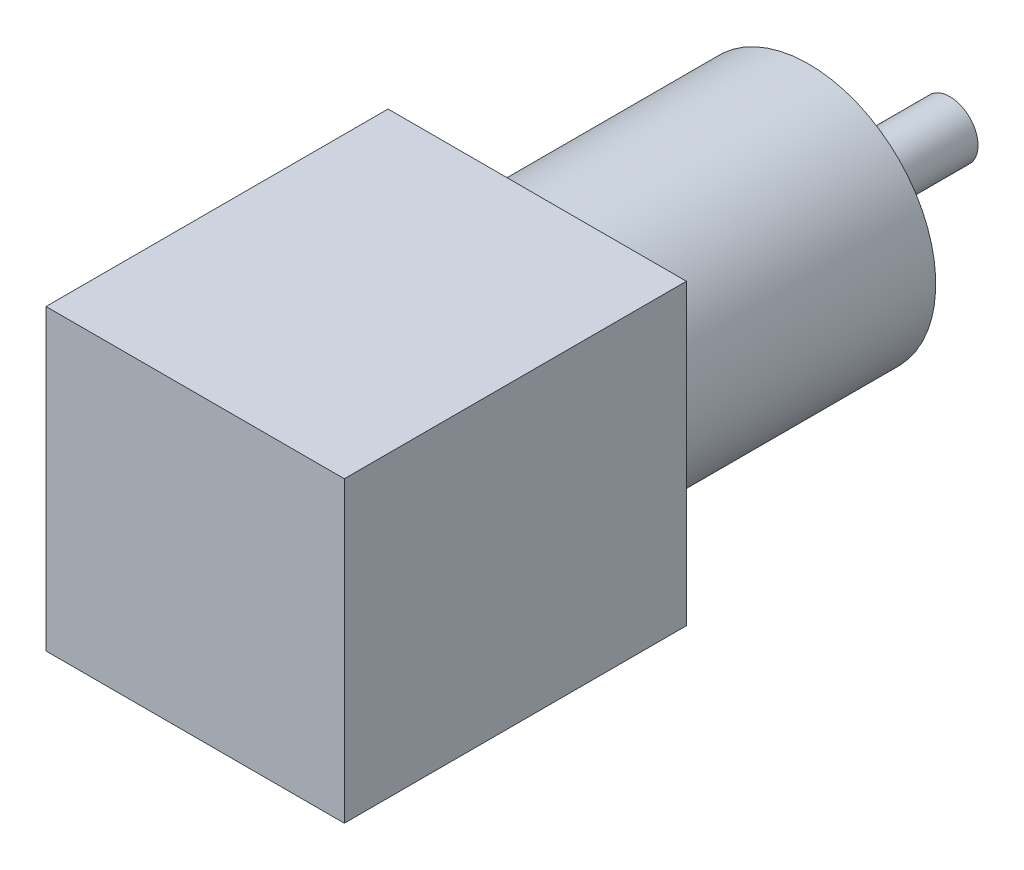
ISO-10303-21;
HEADER;
FILE_DESCRIPTION(('STEP AP214'),'2;1');
FILE_NAME('part.step','',(''),(''),'','','');
FILE_SCHEMA(('AUTOMOTIVE_DESIGN { 1 0 10303 214 1 1 1 1 }'));
ENDSEC;
DATA;
#1=APPLICATION_CONTEXT('core data for automotive mechanical design processes');
#2=APPLICATION_PROTOCOL_DEFINITION('international standard','automotive_design',2000,#1);
#3=PRODUCT_CONTEXT('',#1,'mechanical');
#4=PRODUCT('Part','Part','',(#3));
#5=PRODUCT_RELATED_PRODUCT_CATEGORY('part','',(#4));
#6=PRODUCT_DEFINITION_FORMATION('','',#4);
#7=PRODUCT_DEFINITION_CONTEXT('part definition',#1,'design');
#8=PRODUCT_DEFINITION('design','',#6,#7);
#9=PRODUCT_DEFINITION_SHAPE('','',#8);
#10=(LENGTH_UNIT() NAMED_UNIT(*) SI_UNIT(.MILLI.,.METRE.));
#11=(NAMED_UNIT(*) PLANE_ANGLE_UNIT() SI_UNIT($,.RADIAN.));
#12=(NAMED_UNIT(*) SI_UNIT($,.STERADIAN.) SOLID_ANGLE_UNIT());
#13=UNCERTAINTY_MEASURE_WITH_UNIT(LENGTH_MEASURE(1.E-05),#10,'distance_accuracy_value','');
#14=(GEOMETRIC_REPRESENTATION_CONTEXT(3) GLOBAL_UNCERTAINTY_ASSIGNED_CONTEXT((#13)) GLOBAL_UNIT_ASSIGNED_CONTEXT((#10,
#11,#12)) REPRESENTATION_CONTEXT('',''));
#15=CARTESIAN_POINT('',(0.,0.,0.));
#16=DIRECTION('',(0.,0.,1.));
#17=DIRECTION('',(1.,0.,0.));
#18=AXIS2_PLACEMENT_3D('',#15,#16,#17);
#19=CARTESIAN_POINT('',(21.15,21.15,48.5));
#20=DIRECTION('',(-1.,0.,0.));
#21=DIRECTION('',(0.,0.,1.));
#22=AXIS2_PLACEMENT_3D('',#19,#20,#21);
#23=PLANE('',#22);
#24=DIRECTION('',(0.,1.,0.));
#25=VECTOR('',#24,1.);
#26=CARTESIAN_POINT('',(21.15,21.15,0.));
#27=LINE('',#26,#25);
#28=CARTESIAN_POINT('',(21.15,-21.15,0.));
#29=VERTEX_POINT('',#28);
#30=CARTESIAN_POINT('',(21.15,21.15,0.));
#31=VERTEX_POINT('',#30);
#32=EDGE_CURVE('E107',#29,#31,#27,.T.);
#33=ORIENTED_EDGE('',*,*,#32,.T.);
#34=DIRECTION('',(0.,0.,-1.));
#35=VECTOR('',#34,1.);
#36=CARTESIAN_POINT('',(21.15,21.15,48.5));
#37=LINE('',#36,#35);
#38=CARTESIAN_POINT('',(21.15,21.15,48.5));
#39=VERTEX_POINT('',#38);
#40=EDGE_CURVE('E43',#39,#31,#37,.T.);
#41=ORIENTED_EDGE('',*,*,#40,.F.);
#42=DIRECTION('',(0.,1.,0.));
#43=VECTOR('',#42,1.);
#44=CARTESIAN_POINT('',(21.15,21.15,48.5));
#45=LINE('',#44,#43);
#46=CARTESIAN_POINT('',(21.15,-21.15,48.5));
#47=VERTEX_POINT('',#46);
#48=EDGE_CURVE('E94',#47,#39,#45,.T.);
#49=ORIENTED_EDGE('',*,*,#48,.F.);
#50=DIRECTION('',(0.,0.,-1.));
#51=VECTOR('',#50,1.);
#52=CARTESIAN_POINT('',(21.15,-21.15,48.5));
#53=LINE('',#52,#51);
#54=EDGE_CURVE('E103',#47,#29,#53,.T.);
#55=ORIENTED_EDGE('',*,*,#54,.T.);
#56=EDGE_LOOP('',(#33,#41,#49,#55));
#57=FACE_BOUND('',#56,.T.);
#58=ADVANCED_FACE('F40',(#57),#23,.F.);
#59=CARTESIAN_POINT('',(-21.15,21.15,48.5));
#60=DIRECTION('',(0.,-1.,0.));
#61=DIRECTION('',(0.,0.,-1.));
#62=AXIS2_PLACEMENT_3D('',#59,#60,#61);
#63=PLANE('',#62);
#64=DIRECTION('',(-1.,0.,0.));
#65=VECTOR('',#64,1.);
#66=CARTESIAN_POINT('',(-21.15,21.15,0.));
#67=LINE('',#66,#65);
#68=CARTESIAN_POINT('',(-21.15,21.15,0.));
#69=VERTEX_POINT('',#68);
#70=EDGE_CURVE('E99',#31,#69,#67,.T.);
#71=ORIENTED_EDGE('',*,*,#70,.T.);
#72=DIRECTION('',(0.,0.,-1.));
#73=VECTOR('',#72,1.);
#74=CARTESIAN_POINT('',(-21.15,21.15,48.5));
#75=LINE('',#74,#73);
#76=CARTESIAN_POINT('',(-21.15,21.15,48.5));
#77=VERTEX_POINT('',#76);
#78=EDGE_CURVE('E97',#77,#69,#75,.T.);
#79=ORIENTED_EDGE('',*,*,#78,.F.);
#80=DIRECTION('',(-1.,0.,0.));
#81=VECTOR('',#80,1.);
#82=CARTESIAN_POINT('',(-21.15,21.15,48.5));
#83=LINE('',#82,#81);
#84=EDGE_CURVE('E89',#39,#77,#83,.T.);
#85=ORIENTED_EDGE('',*,*,#84,.F.);
#86=ORIENTED_EDGE('',*,*,#40,.T.);
#87=EDGE_LOOP('',(#71,#79,#85,#86));
#88=FACE_BOUND('',#87,.T.);
#89=ADVANCED_FACE('F98',(#88),#63,.F.);
#90=CARTESIAN_POINT('',(-21.15,21.15,48.5));
#91=DIRECTION('',(1.,0.,0.));
#92=DIRECTION('',(0.,1.,0.));
#93=AXIS2_PLACEMENT_3D('',#90,#91,#92);
#94=PLANE('',#93);
#95=DIRECTION('',(0.,-1.,0.));
#96=VECTOR('',#95,1.);
#97=CARTESIAN_POINT('',(-21.15,21.15,0.));
#98=LINE('',#97,#96);
#99=CARTESIAN_POINT('',(-21.15,-21.15,0.));
#100=VERTEX_POINT('',#99);
#101=EDGE_CURVE('E75',#69,#100,#98,.T.);
#102=ORIENTED_EDGE('',*,*,#101,.T.);
#103=DIRECTION('',(0.,0.,-1.));
#104=VECTOR('',#103,1.);
#105=CARTESIAN_POINT('',(-21.15,-21.15,48.5));
#106=LINE('',#105,#104);
#107=CARTESIAN_POINT('',(-21.15,-21.15,48.5));
#108=VERTEX_POINT('',#107);
#109=EDGE_CURVE('E100',#108,#100,#106,.T.);
#110=ORIENTED_EDGE('',*,*,#109,.F.);
#111=DIRECTION('',(0.,-1.,0.));
#112=VECTOR('',#111,1.);
#113=CARTESIAN_POINT('',(-21.15,21.15,48.5));
#114=LINE('',#113,#112);
#115=EDGE_CURVE('E92',#77,#108,#114,.T.);
#116=ORIENTED_EDGE('',*,*,#115,.F.);
#117=ORIENTED_EDGE('',*,*,#78,.T.);
#118=EDGE_LOOP('',(#102,#110,#116,#117));
#119=FACE_BOUND('',#118,.T.);
#120=ADVANCED_FACE('F101',(#119),#94,.F.);
#121=CARTESIAN_POINT('',(-21.15,-21.15,48.5));
#122=DIRECTION('',(0.,1.,0.));
#123=DIRECTION('',(0.,0.,1.));
#124=AXIS2_PLACEMENT_3D('',#121,#122,#123);
#125=PLANE('',#124);
#126=DIRECTION('',(1.,0.,0.));
#127=VECTOR('',#126,1.);
#128=CARTESIAN_POINT('',(-21.15,-21.15,0.));
#129=LINE('',#128,#127);
#130=EDGE_CURVE('E81',#100,#29,#129,.T.);
#131=ORIENTED_EDGE('',*,*,#130,.T.);
#132=ORIENTED_EDGE('',*,*,#54,.F.);
#133=DIRECTION('',(1.,0.,0.));
#134=VECTOR('',#133,1.);
#135=CARTESIAN_POINT('',(-21.15,-21.15,48.5));
#136=LINE('',#135,#134);
#137=EDGE_CURVE('E58',#108,#47,#136,.T.);
#138=ORIENTED_EDGE('',*,*,#137,.F.);
#139=ORIENTED_EDGE('',*,*,#109,.T.);
#140=EDGE_LOOP('',(#131,#132,#138,#139));
#141=FACE_BOUND('',#140,.T.);
#142=ADVANCED_FACE('F115',(#141),#125,.F.);
#143=CARTESIAN_POINT('',(0.,0.,48.5));
#144=DIRECTION('',(0.,0.,1.));
#145=DIRECTION('',(1.,0.,0.));
#146=AXIS2_PLACEMENT_3D('',#143,#144,#145);
#147=PLANE('',#146);
#148=ORIENTED_EDGE('',*,*,#48,.T.);
#149=ORIENTED_EDGE('',*,*,#84,.T.);
#150=ORIENTED_EDGE('',*,*,#115,.T.);
#151=ORIENTED_EDGE('',*,*,#137,.T.);
#152=EDGE_LOOP('',(#148,#149,#150,#151));
#153=FACE_BOUND('',#152,.T.);
#154=ADVANCED_FACE('F90',(#153),#147,.T.);
#155=CARTESIAN_POINT('',(0.,0.,0.));
#156=DIRECTION('',(0.,0.,1.));
#157=DIRECTION('',(1.,0.,0.));
#158=AXIS2_PLACEMENT_3D('',#155,#156,#157);
#159=PLANE('',#158);
#160=CARTESIAN_POINT('',(0.,0.,0.));
#161=DIRECTION('',(0.,0.,-1.));
#162=DIRECTION('',(-1.,0.,0.));
#163=AXIS2_PLACEMENT_3D('',#160,#161,#162);
#164=CIRCLE('',#163,18.);
#165=CARTESIAN_POINT('',(-18.,0.,0.));
#166=VERTEX_POINT('',#165);
#167=EDGE_CURVE('E49',#166,#166,#164,.T.);
#168=ORIENTED_EDGE('',*,*,#167,.F.);
#169=EDGE_LOOP('',(#168));
#170=FACE_BOUND('',#169,.T.);
#171=ORIENTED_EDGE('',*,*,#32,.F.);
#172=ORIENTED_EDGE('',*,*,#130,.F.);
#173=ORIENTED_EDGE('',*,*,#101,.F.);
#174=ORIENTED_EDGE('',*,*,#70,.F.);
#175=EDGE_LOOP('',(#171,#172,#173,#174));
#176=FACE_BOUND('',#175,.T.);
#177=ADVANCED_FACE('F118',(#170,#176),#159,.F.);
#178=CARTESIAN_POINT('',(0.,0.,-38.5));
#179=DIRECTION('',(0.,0.,1.));
#180=DIRECTION('',(1.,0.,0.));
#181=AXIS2_PLACEMENT_3D('',#178,#179,#180);
#182=CYLINDRICAL_SURFACE('',#181,18.);
#183=CARTESIAN_POINT('',(0.,0.,-38.5));
#184=DIRECTION('',(0.,0.,-1.));
#185=DIRECTION('',(-1.,0.,0.));
#186=AXIS2_PLACEMENT_3D('',#183,#184,#185);
#187=CIRCLE('',#186,18.);
#188=CARTESIAN_POINT('',(-18.,0.,-38.5));
#189=VERTEX_POINT('',#188);
#190=EDGE_CURVE('E110',#189,#189,#187,.T.);
#191=ORIENTED_EDGE('',*,*,#190,.F.);
#192=EDGE_LOOP('',(#191));
#193=FACE_BOUND('',#192,.T.);
#194=ORIENTED_EDGE('',*,*,#167,.T.);
#195=EDGE_LOOP('',(#194));
#196=FACE_BOUND('',#195,.T.);
#197=ADVANCED_FACE('F166',(#193,#196),#182,.T.);
#198=CARTESIAN_POINT('',(0.,0.,-38.5));
#199=DIRECTION('',(0.,0.,-1.));
#200=DIRECTION('',(-1.,0.,0.));
#201=AXIS2_PLACEMENT_3D('',#198,#199,#200);
#202=PLANE('',#201);
#203=CARTESIAN_POINT('',(10.6066017177982,-10.6066017177983,-38.5));
#204=DIRECTION('',(0.,0.,-1.));
#205=DIRECTION('',(1.,0.,0.));
#206=AXIS2_PLACEMENT_3D('',#203,#204,#205);
#207=CIRCLE('',#206,1.5);
#208=CARTESIAN_POINT('',(12.1066017177982,-10.6066017177983,-38.5));
#209=VERTEX_POINT('',#208);
#210=EDGE_CURVE('E135',#209,#209,#207,.T.);
#211=ORIENTED_EDGE('',*,*,#210,.F.);
#212=EDGE_LOOP('',(#211));
#213=FACE_BOUND('',#212,.T.);
#214=CARTESIAN_POINT('',(-10.6066017177982,-10.6066017177983,-38.5));
#215=DIRECTION('',(0.,0.,-1.));
#216=DIRECTION('',(-1.,0.,0.));
#217=AXIS2_PLACEMENT_3D('',#214,#215,#216);
#218=CIRCLE('',#217,1.5);
#219=CARTESIAN_POINT('',(-12.1066017177982,-10.6066017177983,-38.5));
#220=VERTEX_POINT('',#219);
#221=EDGE_CURVE('E141',#220,#220,#218,.T.);
#222=ORIENTED_EDGE('',*,*,#221,.F.);
#223=EDGE_LOOP('',(#222));
#224=FACE_BOUND('',#223,.T.);
#225=CARTESIAN_POINT('',(-10.6066017177982,10.6066017177983,-38.5));
#226=DIRECTION('',(0.,0.,-1.));
#227=DIRECTION('',(1.,0.,0.));
#228=AXIS2_PLACEMENT_3D('',#225,#226,#227);
#229=CIRCLE('',#228,1.5);
#230=CARTESIAN_POINT('',(-9.10660171779816,10.6066017177983,-38.5));
#231=VERTEX_POINT('',#230);
#232=EDGE_CURVE('E147',#231,#231,#229,.T.);
#233=ORIENTED_EDGE('',*,*,#232,.F.);
#234=EDGE_LOOP('',(#233));
#235=FACE_BOUND('',#234,.T.);
#236=CARTESIAN_POINT('',(10.6066017177982,10.6066017177983,-38.5));
#237=DIRECTION('',(0.,0.,-1.));
#238=DIRECTION('',(-1.,0.,0.));
#239=AXIS2_PLACEMENT_3D('',#236,#237,#238);
#240=CIRCLE('',#239,1.5);
#241=CARTESIAN_POINT('',(9.10660171779816,10.6066017177983,-38.5));
#242=VERTEX_POINT('',#241);
#243=EDGE_CURVE('E129',#242,#242,#240,.T.);
#244=ORIENTED_EDGE('',*,*,#243,.F.);
#245=EDGE_LOOP('',(#244));
#246=FACE_BOUND('',#245,.T.);
#247=CARTESIAN_POINT('',(0.,0.,-38.5));
#248=DIRECTION('',(0.,0.,-1.));
#249=DIRECTION('',(-1.,0.,0.));
#250=AXIS2_PLACEMENT_3D('',#247,#248,#249);
#251=CIRCLE('',#250,4.);
#252=CARTESIAN_POINT('',(-4.,0.,-38.5));
#253=VERTEX_POINT('',#252);
#254=EDGE_CURVE('E11',#253,#253,#251,.T.);
#255=ORIENTED_EDGE('',*,*,#254,.F.);
#256=EDGE_LOOP('',(#255));
#257=FACE_BOUND('',#256,.T.);
#258=ORIENTED_EDGE('',*,*,#190,.T.);
#259=EDGE_LOOP('',(#258));
#260=FACE_BOUND('',#259,.T.);
#261=ADVANCED_FACE('F162',(#213,#224,#235,#246,#257,#260),#202,.T.);
#262=CARTESIAN_POINT('',(0.,0.,-58.5));
#263=DIRECTION('',(0.,0.,1.));
#264=DIRECTION('',(1.,0.,0.));
#265=AXIS2_PLACEMENT_3D('',#262,#263,#264);
#266=CYLINDRICAL_SURFACE('',#265,4.);
#267=CARTESIAN_POINT('',(0.,0.,-58.5));
#268=DIRECTION('',(0.,0.,-1.));
#269=DIRECTION('',(-1.,0.,0.));
#270=AXIS2_PLACEMENT_3D('',#267,#268,#269);
#271=CIRCLE('',#270,4.);
#272=CARTESIAN_POINT('',(-4.,0.,-58.5));
#273=VERTEX_POINT('',#272);
#274=EDGE_CURVE('E124',#273,#273,#271,.T.);
#275=ORIENTED_EDGE('',*,*,#274,.F.);
#276=EDGE_LOOP('',(#275));
#277=FACE_BOUND('',#276,.T.);
#278=ORIENTED_EDGE('',*,*,#254,.T.);
#279=EDGE_LOOP('',(#278));
#280=FACE_BOUND('',#279,.T.);
#281=ADVANCED_FACE('F165',(#277,#280),#266,.T.);
#282=CARTESIAN_POINT('',(0.,0.,-58.5));
#283=DIRECTION('',(0.,0.,-1.));
#284=DIRECTION('',(-1.,0.,0.));
#285=AXIS2_PLACEMENT_3D('',#282,#283,#284);
#286=PLANE('',#285);
#287=ORIENTED_EDGE('',*,*,#274,.T.);
#288=EDGE_LOOP('',(#287));
#289=FACE_BOUND('',#288,.T.);
#290=ADVANCED_FACE('F224',(#289),#286,.T.);
#291=CARTESIAN_POINT('',(10.6066017177982,10.6066017177983,-28.5));
#292=DIRECTION('',(0.,0.,-1.));
#293=DIRECTION('',(-1.,0.,0.));
#294=AXIS2_PLACEMENT_3D('',#291,#292,#293);
#295=CYLINDRICAL_SURFACE('',#294,1.5);
#296=CARTESIAN_POINT('',(10.6066017177982,10.6066017177983,-28.5));
#297=DIRECTION('',(0.,0.,-1.));
#298=DIRECTION('',(-1.,0.,0.));
#299=AXIS2_PLACEMENT_3D('',#296,#297,#298);
#300=CIRCLE('',#299,1.5);
#301=CARTESIAN_POINT('',(9.10660171779816,10.6066017177983,-28.5));
#302=VERTEX_POINT('',#301);
#303=EDGE_CURVE('E128',#302,#302,#300,.T.);
#304=ORIENTED_EDGE('',*,*,#303,.F.);
#305=EDGE_LOOP('',(#304));
#306=FACE_BOUND('',#305,.T.);
#307=ORIENTED_EDGE('',*,*,#243,.T.);
#308=EDGE_LOOP('',(#307));
#309=FACE_BOUND('',#308,.T.);
#310=ADVANCED_FACE('F234',(#306,#309),#295,.F.);
#311=CARTESIAN_POINT('',(10.6066017177982,10.6066017177983,-28.5));
#312=DIRECTION('',(0.,0.,-1.));
#313=DIRECTION('',(-1.,0.,0.));
#314=AXIS2_PLACEMENT_3D('',#311,#312,#313);
#315=PLANE('',#314);
#316=ORIENTED_EDGE('',*,*,#303,.T.);
#317=EDGE_LOOP('',(#316));
#318=FACE_BOUND('',#317,.T.);
#319=ADVANCED_FACE('F158',(#318),#315,.T.);
#320=CARTESIAN_POINT('',(-10.6066017177982,10.6066017177983,-28.5));
#321=DIRECTION('',(0.,0.,-1.));
#322=DIRECTION('',(-1.,0.,0.));
#323=AXIS2_PLACEMENT_3D('',#320,#321,#322);
#324=CYLINDRICAL_SURFACE('',#323,1.5);
#325=CARTESIAN_POINT('',(-10.6066017177982,10.6066017177983,-28.5));
#326=DIRECTION('',(0.,0.,-1.));
#327=DIRECTION('',(1.,0.,0.));
#328=AXIS2_PLACEMENT_3D('',#325,#326,#327);
#329=CIRCLE('',#328,1.5);
#330=CARTESIAN_POINT('',(-9.10660171779816,10.6066017177983,-28.5));
#331=VERTEX_POINT('',#330);
#332=EDGE_CURVE('E132',#331,#331,#329,.T.);
#333=ORIENTED_EDGE('',*,*,#332,.F.);
#334=EDGE_LOOP('',(#333));
#335=FACE_BOUND('',#334,.T.);
#336=ORIENTED_EDGE('',*,*,#232,.T.);
#337=EDGE_LOOP('',(#336));
#338=FACE_BOUND('',#337,.T.);
#339=ADVANCED_FACE('F155',(#335,#338),#324,.F.);
#340=CARTESIAN_POINT('',(-10.6066017177982,10.6066017177983,-28.5));
#341=DIRECTION('',(0.,0.,1.));
#342=DIRECTION('',(1.,0.,0.));
#343=AXIS2_PLACEMENT_3D('',#340,#341,#342);
#344=PLANE('',#343);
#345=ORIENTED_EDGE('',*,*,#332,.T.);
#346=EDGE_LOOP('',(#345));
#347=FACE_BOUND('',#346,.T.);
#348=ADVANCED_FACE('F153',(#347),#344,.F.);
#349=CARTESIAN_POINT('',(-10.6066017177982,-10.6066017177983,-28.5));
#350=DIRECTION('',(0.,0.,-1.));
#351=DIRECTION('',(-1.,0.,0.));
#352=AXIS2_PLACEMENT_3D('',#349,#350,#351);
#353=CYLINDRICAL_SURFACE('',#352,1.5);
#354=CARTESIAN_POINT('',(-10.6066017177982,-10.6066017177983,-28.5));
#355=DIRECTION('',(0.,0.,-1.));
#356=DIRECTION('',(-1.,0.,0.));
#357=AXIS2_PLACEMENT_3D('',#354,#355,#356);
#358=CIRCLE('',#357,1.5);
#359=CARTESIAN_POINT('',(-12.1066017177982,-10.6066017177983,-28.5));
#360=VERTEX_POINT('',#359);
#361=EDGE_CURVE('E144',#360,#360,#358,.T.);
#362=ORIENTED_EDGE('',*,*,#361,.F.);
#363=EDGE_LOOP('',(#362));
#364=FACE_BOUND('',#363,.T.);
#365=ORIENTED_EDGE('',*,*,#221,.T.);
#366=EDGE_LOOP('',(#365));
#367=FACE_BOUND('',#366,.T.);
#368=ADVANCED_FACE('F273',(#364,#367),#353,.F.);
#369=CARTESIAN_POINT('',(-10.6066017177982,-10.6066017177983,-28.5));
#370=DIRECTION('',(0.,0.,-1.));
#371=DIRECTION('',(-1.,0.,0.));
#372=AXIS2_PLACEMENT_3D('',#369,#370,#371);
#373=PLANE('',#372);
#374=ORIENTED_EDGE('',*,*,#361,.T.);
#375=EDGE_LOOP('',(#374));
#376=FACE_BOUND('',#375,.T.);
#377=ADVANCED_FACE('F282',(#376),#373,.T.);
#378=CARTESIAN_POINT('',(10.6066017177982,-10.6066017177983,-28.5));
#379=DIRECTION('',(0.,0.,-1.));
#380=DIRECTION('',(-1.,0.,0.));
#381=AXIS2_PLACEMENT_3D('',#378,#379,#380);
#382=CYLINDRICAL_SURFACE('',#381,1.5);
#383=CARTESIAN_POINT('',(10.6066017177982,-10.6066017177983,-28.5));
#384=DIRECTION('',(0.,0.,-1.));
#385=DIRECTION('',(1.,0.,0.));
#386=AXIS2_PLACEMENT_3D('',#383,#384,#385);
#387=CIRCLE('',#386,1.5);
#388=CARTESIAN_POINT('',(12.1066017177982,-10.6066017177983,-28.5));
#389=VERTEX_POINT('',#388);
#390=EDGE_CURVE('E138',#389,#389,#387,.T.);
#391=ORIENTED_EDGE('',*,*,#390,.F.);
#392=EDGE_LOOP('',(#391));
#393=FACE_BOUND('',#392,.T.);
#394=ORIENTED_EDGE('',*,*,#210,.T.);
#395=EDGE_LOOP('',(#394));
#396=FACE_BOUND('',#395,.T.);
#397=ADVANCED_FACE('F292',(#393,#396),#382,.F.);
#398=CARTESIAN_POINT('',(10.6066017177982,-10.6066017177983,-28.5));
#399=DIRECTION('',(0.,0.,1.));
#400=DIRECTION('',(1.,0.,0.));
#401=AXIS2_PLACEMENT_3D('',#398,#399,#400);
#402=PLANE('',#401);
#403=ORIENTED_EDGE('',*,*,#390,.T.);
#404=EDGE_LOOP('',(#403));
#405=FACE_BOUND('',#404,.T.);
#406=ADVANCED_FACE('F302',(#405),#402,.F.);
#407=CLOSED_SHELL('',(#58,#89,#120,#142,#154,#177,#197,#261,#281,#290,#310,#319,#339,#348,#368,
#377,#397,#406));
#408=MANIFOLD_SOLID_BREP('B2',#407);
#409=ADVANCED_BREP_SHAPE_REPRESENTATION('',(#18,#408),#14);
#410=SHAPE_DEFINITION_REPRESENTATION(#9,#409);
ENDSEC;
END-ISO-10303-21;
